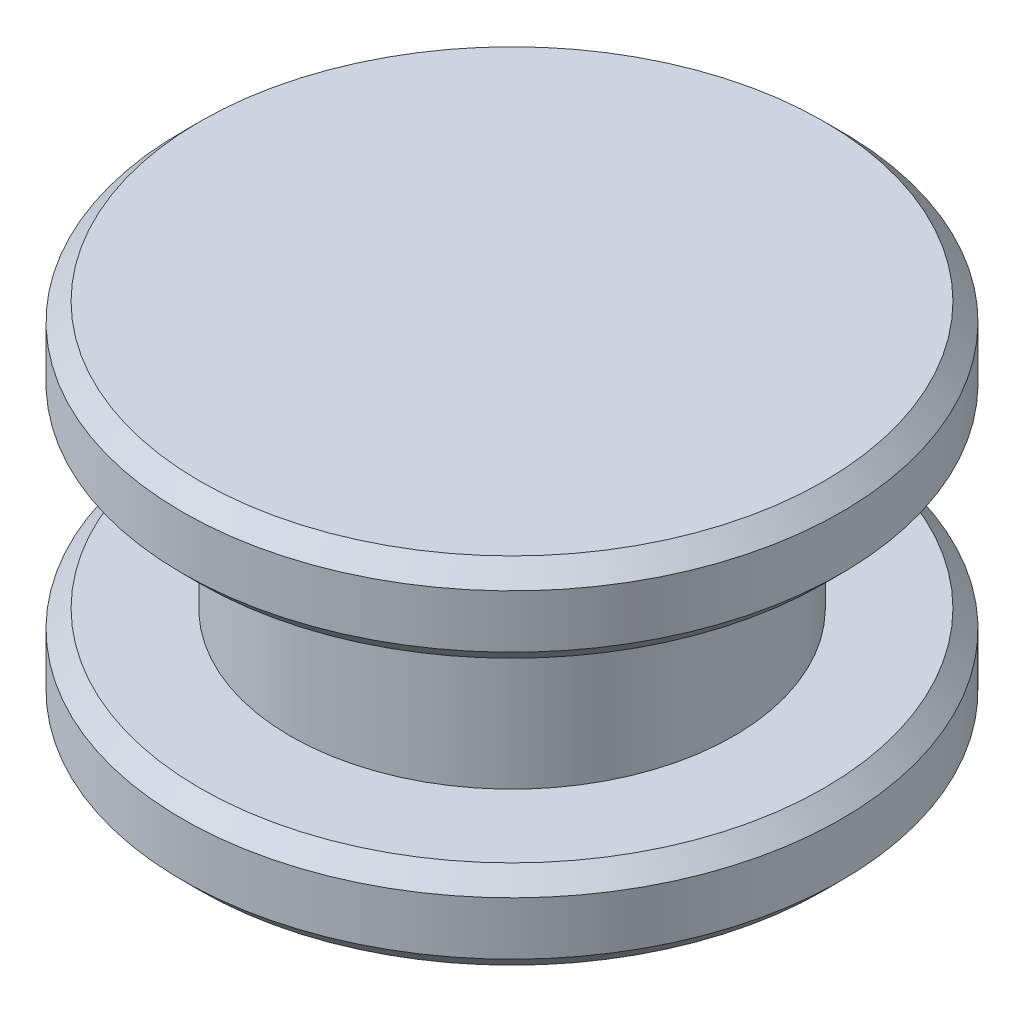
ISO-10303-21;
HEADER;
FILE_DESCRIPTION(('STEP AP214'),'2;1');
FILE_NAME('part.step','',(''),(''),'','','');
FILE_SCHEMA(('AUTOMOTIVE_DESIGN { 1 0 10303 214 1 1 1 1 }'));
ENDSEC;
DATA;
#1=APPLICATION_CONTEXT('core data for automotive mechanical design processes');
#2=APPLICATION_PROTOCOL_DEFINITION('international standard','automotive_design',2000,#1);
#3=PRODUCT_CONTEXT('',#1,'mechanical');
#4=PRODUCT('Part','Part','',(#3));
#5=PRODUCT_RELATED_PRODUCT_CATEGORY('part','',(#4));
#6=PRODUCT_DEFINITION_FORMATION('','',#4);
#7=PRODUCT_DEFINITION_CONTEXT('part definition',#1,'design');
#8=PRODUCT_DEFINITION('design','',#6,#7);
#9=PRODUCT_DEFINITION_SHAPE('','',#8);
#10=(LENGTH_UNIT() NAMED_UNIT(*) SI_UNIT(.MILLI.,.METRE.));
#11=(NAMED_UNIT(*) PLANE_ANGLE_UNIT() SI_UNIT($,.RADIAN.));
#12=(NAMED_UNIT(*) SI_UNIT($,.STERADIAN.) SOLID_ANGLE_UNIT());
#13=UNCERTAINTY_MEASURE_WITH_UNIT(LENGTH_MEASURE(1.E-05),#10,'distance_accuracy_value','');
#14=(GEOMETRIC_REPRESENTATION_CONTEXT(3) GLOBAL_UNCERTAINTY_ASSIGNED_CONTEXT((#13)) GLOBAL_UNIT_ASSIGNED_CONTEXT((#10,
#11,#12)) REPRESENTATION_CONTEXT('',''));
#15=CARTESIAN_POINT('',(0.,0.,0.));
#16=DIRECTION('',(0.,0.,1.));
#17=DIRECTION('',(1.,0.,0.));
#18=AXIS2_PLACEMENT_3D('',#15,#16,#17);
#19=CARTESIAN_POINT('',(0.,0.2,0.));
#20=DIRECTION('',(0.,-1.,0.));
#21=DIRECTION('',(0.,0.,-1.));
#22=AXIS2_PLACEMENT_3D('',#19,#20,#21);
#23=CYLINDRICAL_SURFACE('',#22,0.25);
#24=CARTESIAN_POINT('',(0.,0.2,0.));
#25=DIRECTION('',(0.,1.,0.));
#26=DIRECTION('',(0.,0.,1.));
#27=AXIS2_PLACEMENT_3D('',#24,#25,#26);
#28=CIRCLE('',#27,0.25);
#29=CARTESIAN_POINT('',(0.,0.2,0.25));
#30=VERTEX_POINT('',#29);
#31=EDGE_CURVE('E77',#30,#30,#28,.T.);
#32=ORIENTED_EDGE('',*,*,#31,.F.);
#33=EDGE_LOOP('',(#32));
#34=FACE_BOUND('',#33,.T.);
#35=CARTESIAN_POINT('',(0.,0.,0.));
#36=DIRECTION('',(0.,1.,0.));
#37=DIRECTION('',(0.,0.,1.));
#38=AXIS2_PLACEMENT_3D('',#35,#36,#37);
#39=CIRCLE('',#38,0.25);
#40=CARTESIAN_POINT('',(0.,0.,0.25));
#41=VERTEX_POINT('',#40);
#42=EDGE_CURVE('E78',#41,#41,#39,.T.);
#43=ORIENTED_EDGE('',*,*,#42,.T.);
#44=EDGE_LOOP('',(#43));
#45=FACE_BOUND('',#44,.T.);
#46=ADVANCED_FACE('F37',(#34,#45),#23,.T.);
#47=CARTESIAN_POINT('',(0.,0.3,0.));
#48=DIRECTION('',(0.,-1.,0.));
#49=DIRECTION('',(0.,0.,-1.));
#50=AXIS2_PLACEMENT_3D('',#47,#48,#49);
#51=CYLINDRICAL_SURFACE('',#50,0.371871199051348);
#52=CARTESIAN_POINT('',(0.,0.22,0.));
#53=DIRECTION('',(0.,1.,0.));
#54=DIRECTION('',(0.,0.,1.));
#55=AXIS2_PLACEMENT_3D('',#52,#53,#54);
#56=CIRCLE('',#55,0.371871199051348);
#57=CARTESIAN_POINT('',(0.,0.22,0.371871199051348));
#58=VERTEX_POINT('',#57);
#59=EDGE_CURVE('E55',#58,#58,#56,.T.);
#60=ORIENTED_EDGE('',*,*,#59,.T.);
#61=EDGE_LOOP('',(#60));
#62=FACE_BOUND('',#61,.T.);
#63=CARTESIAN_POINT('',(0.,0.28,0.));
#64=DIRECTION('',(0.,1.,0.));
#65=DIRECTION('',(0.,0.,1.));
#66=AXIS2_PLACEMENT_3D('',#63,#64,#65);
#67=CIRCLE('',#66,0.371871199051348);
#68=CARTESIAN_POINT('',(0.,0.28,0.371871199051348));
#69=VERTEX_POINT('',#68);
#70=EDGE_CURVE('E69',#69,#69,#67,.F.);
#71=ORIENTED_EDGE('',*,*,#70,.T.);
#72=EDGE_LOOP('',(#71));
#73=FACE_BOUND('',#72,.T.);
#74=ADVANCED_FACE('F90',(#62,#73),#51,.T.);
#75=CARTESIAN_POINT('',(0.,0.3,0.));
#76=DIRECTION('',(0.,1.,0.));
#77=DIRECTION('',(0.,0.,1.));
#78=AXIS2_PLACEMENT_3D('',#75,#76,#77);
#79=PLANE('',#78);
#80=CARTESIAN_POINT('',(0.,0.3,0.));
#81=DIRECTION('',(0.,1.,0.));
#82=DIRECTION('',(0.,0.,1.));
#83=AXIS2_PLACEMENT_3D('',#80,#81,#82);
#84=CIRCLE('',#83,0.351871199051348);
#85=CARTESIAN_POINT('',(0.,0.3,0.351871199051348));
#86=VERTEX_POINT('',#85);
#87=EDGE_CURVE('E73',#86,#86,#84,.T.);
#88=ORIENTED_EDGE('',*,*,#87,.T.);
#89=EDGE_LOOP('',(#88));
#90=FACE_BOUND('',#89,.T.);
#91=ADVANCED_FACE('F112',(#90),#79,.T.);
#92=CARTESIAN_POINT('',(0.,0.2,0.));
#93=DIRECTION('',(0.,1.,0.));
#94=DIRECTION('',(0.,0.,1.));
#95=AXIS2_PLACEMENT_3D('',#92,#93,#94);
#96=PLANE('',#95);
#97=CARTESIAN_POINT('',(0.,0.2,0.));
#98=DIRECTION('',(0.,1.,0.));
#99=DIRECTION('',(0.,0.,1.));
#100=AXIS2_PLACEMENT_3D('',#97,#98,#99);
#101=CIRCLE('',#100,0.351871199051348);
#102=CARTESIAN_POINT('',(0.,0.2,0.351871199051348));
#103=VERTEX_POINT('',#102);
#104=EDGE_CURVE('E50',#103,#103,#101,.F.);
#105=ORIENTED_EDGE('',*,*,#104,.T.);
#106=EDGE_LOOP('',(#105));
#107=FACE_BOUND('',#106,.T.);
#108=ORIENTED_EDGE('',*,*,#31,.T.);
#109=EDGE_LOOP('',(#108));
#110=FACE_BOUND('',#109,.T.);
#111=ADVANCED_FACE('F86',(#107,#110),#96,.F.);
#112=CARTESIAN_POINT('',(0.,-0.1,0.));
#113=DIRECTION('',(0.,1.,0.));
#114=DIRECTION('',(0.,0.,1.));
#115=AXIS2_PLACEMENT_3D('',#112,#113,#114);
#116=CYLINDRICAL_SURFACE('',#115,0.371871199051348);
#117=CARTESIAN_POINT('',(0.,-0.0799999999999998,0.));
#118=DIRECTION('',(0.,-1.,0.));
#119=DIRECTION('',(0.,0.,-1.));
#120=AXIS2_PLACEMENT_3D('',#117,#118,#119);
#121=CIRCLE('',#120,0.371871199051348);
#122=CARTESIAN_POINT('',(0.,-0.0799999999999998,-0.371871199051348));
#123=VERTEX_POINT('',#122);
#124=EDGE_CURVE('E10',#123,#123,#121,.F.);
#125=ORIENTED_EDGE('',*,*,#124,.T.);
#126=EDGE_LOOP('',(#125));
#127=FACE_BOUND('',#126,.T.);
#128=CARTESIAN_POINT('',(0.,-0.0200000000000001,0.));
#129=DIRECTION('',(0.,-1.,0.));
#130=DIRECTION('',(0.,0.,-1.));
#131=AXIS2_PLACEMENT_3D('',#128,#129,#130);
#132=CIRCLE('',#131,0.371871199051348);
#133=CARTESIAN_POINT('',(0.,-0.0200000000000001,-0.371871199051348));
#134=VERTEX_POINT('',#133);
#135=EDGE_CURVE('E65',#134,#134,#132,.T.);
#136=ORIENTED_EDGE('',*,*,#135,.T.);
#137=EDGE_LOOP('',(#136));
#138=FACE_BOUND('',#137,.T.);
#139=ADVANCED_FACE('F107',(#127,#138),#116,.T.);
#140=CARTESIAN_POINT('',(0.,-0.1,0.));
#141=DIRECTION('',(0.,-1.,0.));
#142=DIRECTION('',(0.,0.,-1.));
#143=AXIS2_PLACEMENT_3D('',#140,#141,#142);
#144=PLANE('',#143);
#145=CARTESIAN_POINT('',(0.,-0.1,0.));
#146=DIRECTION('',(0.,-1.,0.));
#147=DIRECTION('',(0.,0.,-1.));
#148=AXIS2_PLACEMENT_3D('',#145,#146,#147);
#149=CIRCLE('',#148,0.351871199051348);
#150=CARTESIAN_POINT('',(0.,-0.1,-0.351871199051348));
#151=VERTEX_POINT('',#150);
#152=EDGE_CURVE('E45',#151,#151,#149,.T.);
#153=ORIENTED_EDGE('',*,*,#152,.T.);
#154=EDGE_LOOP('',(#153));
#155=FACE_BOUND('',#154,.T.);
#156=ADVANCED_FACE('F97',(#155),#144,.T.);
#157=CARTESIAN_POINT('',(0.,0.,0.));
#158=DIRECTION('',(0.,-1.,0.));
#159=DIRECTION('',(0.,0.,-1.));
#160=AXIS2_PLACEMENT_3D('',#157,#158,#159);
#161=PLANE('',#160);
#162=CARTESIAN_POINT('',(0.,0.,0.));
#163=DIRECTION('',(0.,-1.,0.));
#164=DIRECTION('',(0.,0.,-1.));
#165=AXIS2_PLACEMENT_3D('',#162,#163,#164);
#166=CIRCLE('',#165,0.351871199051348);
#167=CARTESIAN_POINT('',(0.,0.,-0.351871199051348));
#168=VERTEX_POINT('',#167);
#169=EDGE_CURVE('E61',#168,#168,#166,.F.);
#170=ORIENTED_EDGE('',*,*,#169,.T.);
#171=EDGE_LOOP('',(#170));
#172=FACE_BOUND('',#171,.T.);
#173=ORIENTED_EDGE('',*,*,#42,.F.);
#174=EDGE_LOOP('',(#173));
#175=FACE_BOUND('',#174,.T.);
#176=ADVANCED_FACE('F94',(#172,#175),#161,.F.);
#177=CARTESIAN_POINT('',(0.,0.3,0.));
#178=DIRECTION('',(0.,-1.,0.));
#179=DIRECTION('',(0.,0.,-1.));
#180=AXIS2_PLACEMENT_3D('',#177,#178,#179);
#181=CONICAL_SURFACE('',#180,0.351871199051348,0.785398163397447);
#182=ORIENTED_EDGE('',*,*,#70,.F.);
#183=EDGE_LOOP('',(#182));
#184=FACE_BOUND('',#183,.T.);
#185=ORIENTED_EDGE('',*,*,#87,.F.);
#186=EDGE_LOOP('',(#185));
#187=FACE_BOUND('',#186,.T.);
#188=ADVANCED_FACE('F96',(#184,#187),#181,.T.);
#189=CARTESIAN_POINT('',(0.,-0.0200000000000001,0.));
#190=DIRECTION('',(0.,-1.,0.));
#191=DIRECTION('',(0.,0.,-1.));
#192=AXIS2_PLACEMENT_3D('',#189,#190,#191);
#193=CONICAL_SURFACE('',#192,0.371871199051348,0.785398163397452);
#194=ORIENTED_EDGE('',*,*,#169,.F.);
#195=EDGE_LOOP('',(#194));
#196=FACE_BOUND('',#195,.T.);
#197=ORIENTED_EDGE('',*,*,#135,.F.);
#198=EDGE_LOOP('',(#197));
#199=FACE_BOUND('',#198,.T.);
#200=ADVANCED_FACE('F104',(#196,#199),#193,.T.);
#201=CARTESIAN_POINT('',(0.,0.22,0.));
#202=DIRECTION('',(0.,1.,0.));
#203=DIRECTION('',(0.,0.,1.));
#204=AXIS2_PLACEMENT_3D('',#201,#202,#203);
#205=CONICAL_SURFACE('',#204,0.371871199051348,0.785398163397448);
#206=ORIENTED_EDGE('',*,*,#104,.F.);
#207=EDGE_LOOP('',(#206));
#208=FACE_BOUND('',#207,.T.);
#209=ORIENTED_EDGE('',*,*,#59,.F.);
#210=EDGE_LOOP('',(#209));
#211=FACE_BOUND('',#210,.T.);
#212=ADVANCED_FACE('F123',(#208,#211),#205,.T.);
#213=CARTESIAN_POINT('',(0.,-0.1,0.));
#214=DIRECTION('',(0.,1.,0.));
#215=DIRECTION('',(0.,0.,1.));
#216=AXIS2_PLACEMENT_3D('',#213,#214,#215);
#217=CONICAL_SURFACE('',#216,0.351871199051348,0.785398163397447);
#218=ORIENTED_EDGE('',*,*,#124,.F.);
#219=EDGE_LOOP('',(#218));
#220=FACE_BOUND('',#219,.T.);
#221=ORIENTED_EDGE('',*,*,#152,.F.);
#222=EDGE_LOOP('',(#221));
#223=FACE_BOUND('',#222,.T.);
#224=ADVANCED_FACE('F39',(#220,#223),#217,.T.);
#225=CLOSED_SHELL('',(#46,#74,#91,#111,#139,#156,#176,#188,#200,#212,#224));
#226=MANIFOLD_SOLID_BREP('B2',#225);
#227=ADVANCED_BREP_SHAPE_REPRESENTATION('',(#18,#226),#14);
#228=SHAPE_DEFINITION_REPRESENTATION(#9,#227);
ENDSEC;
END-ISO-10303-21;
